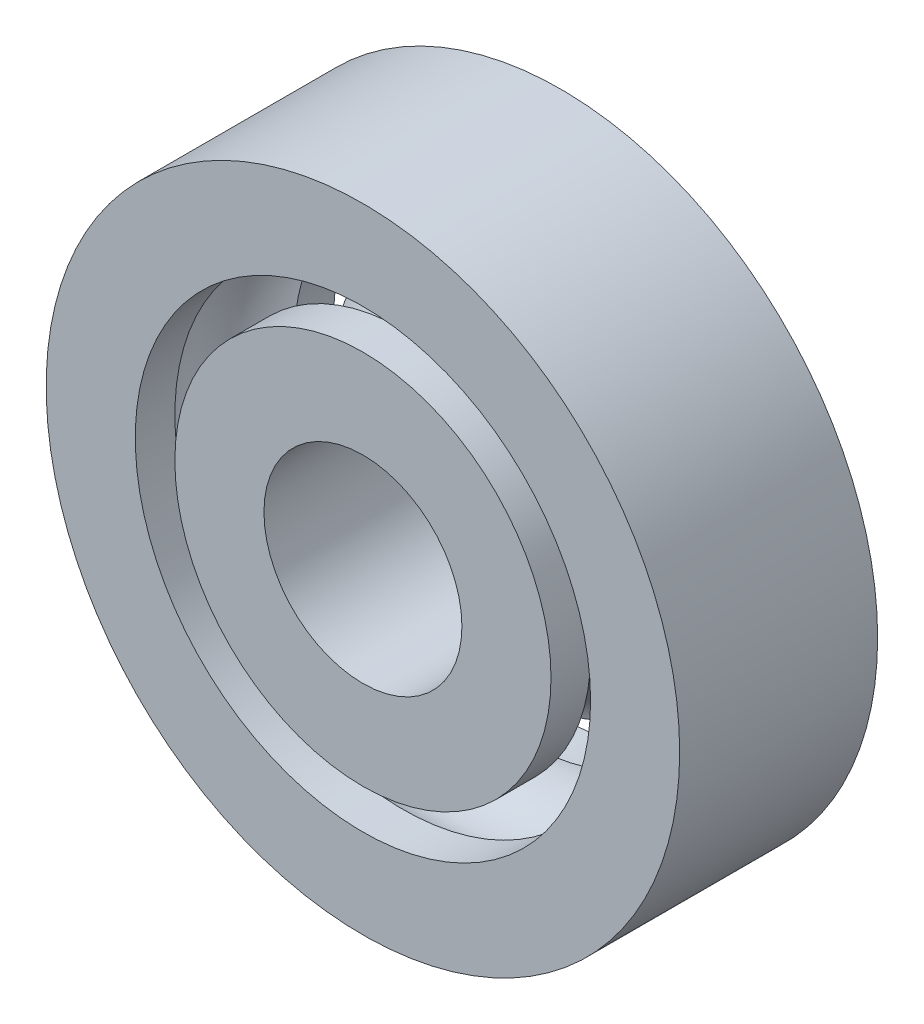
ISO-10303-21;
HEADER;
FILE_DESCRIPTION(('STEP AP214'),'2;1');
FILE_NAME('part.step','',(''),(''),'','','');
FILE_SCHEMA(('AUTOMOTIVE_DESIGN { 1 0 10303 214 1 1 1 1 }'));
ENDSEC;
DATA;
#1=APPLICATION_CONTEXT('core data for automotive mechanical design processes');
#2=APPLICATION_PROTOCOL_DEFINITION('international standard','automotive_design',2000,#1);
#3=PRODUCT_CONTEXT('',#1,'mechanical');
#4=PRODUCT('Part','Part','',(#3));
#5=PRODUCT_RELATED_PRODUCT_CATEGORY('part','',(#4));
#6=PRODUCT_DEFINITION_FORMATION('','',#4);
#7=PRODUCT_DEFINITION_CONTEXT('part definition',#1,'design');
#8=PRODUCT_DEFINITION('design','',#6,#7);
#9=PRODUCT_DEFINITION_SHAPE('','',#8);
#10=(LENGTH_UNIT() NAMED_UNIT(*) SI_UNIT(.MILLI.,.METRE.));
#11=(NAMED_UNIT(*) PLANE_ANGLE_UNIT() SI_UNIT($,.RADIAN.));
#12=(NAMED_UNIT(*) SI_UNIT($,.STERADIAN.) SOLID_ANGLE_UNIT());
#13=UNCERTAINTY_MEASURE_WITH_UNIT(LENGTH_MEASURE(1.E-05),#10,'distance_accuracy_value','');
#14=(GEOMETRIC_REPRESENTATION_CONTEXT(3) GLOBAL_UNCERTAINTY_ASSIGNED_CONTEXT((#13)) GLOBAL_UNIT_ASSIGNED_CONTEXT((#10,
#11,#12)) REPRESENTATION_CONTEXT('',''));
#15=CARTESIAN_POINT('',(0.,0.,0.));
#16=DIRECTION('',(0.,0.,1.));
#17=DIRECTION('',(1.,0.,0.));
#18=AXIS2_PLACEMENT_3D('',#15,#16,#17);
#19=CARTESIAN_POINT('',(0.,0.,2.5));
#20=DIRECTION('',(0.,0.,1.));
#21=DIRECTION('',(1.,0.,0.));
#22=AXIS2_PLACEMENT_3D('',#19,#20,#21);
#23=PLANE('',#22);
#24=CARTESIAN_POINT('',(0.,0.,2.5));
#25=DIRECTION('',(0.,0.,1.));
#26=DIRECTION('',(1.,0.,0.));
#27=AXIS2_PLACEMENT_3D('',#24,#25,#26);
#28=CIRCLE('',#27,8.);
#29=CARTESIAN_POINT('',(8.,0.,2.5));
#30=VERTEX_POINT('',#29);
#31=EDGE_CURVE('E55',#30,#30,#28,.T.);
#32=ORIENTED_EDGE('',*,*,#31,.T.);
#33=EDGE_LOOP('',(#32));
#34=FACE_BOUND('',#33,.T.);
#35=CARTESIAN_POINT('',(0.,0.,2.5));
#36=DIRECTION('',(0.,0.,1.));
#37=DIRECTION('',(1.,0.,0.));
#38=AXIS2_PLACEMENT_3D('',#35,#36,#37);
#39=CIRCLE('',#38,5.75);
#40=CARTESIAN_POINT('',(5.75,0.,2.5));
#41=VERTEX_POINT('',#40);
#42=EDGE_CURVE('E11',#41,#41,#39,.T.);
#43=ORIENTED_EDGE('',*,*,#42,.F.);
#44=EDGE_LOOP('',(#43));
#45=FACE_BOUND('',#44,.T.);
#46=ADVANCED_FACE('F49',(#34,#45),#23,.T.);
#47=CARTESIAN_POINT('',(0.,0.,2.5));
#48=DIRECTION('',(0.,0.,1.));
#49=DIRECTION('',(1.,0.,0.));
#50=AXIS2_PLACEMENT_3D('',#47,#48,#49);
#51=CYLINDRICAL_SURFACE('',#50,5.75);
#52=CARTESIAN_POINT('',(0.,0.,1.5));
#53=DIRECTION('',(0.,0.,1.));
#54=DIRECTION('',(1.,0.,0.));
#55=AXIS2_PLACEMENT_3D('',#52,#53,#54);
#56=CIRCLE('',#55,5.75);
#57=CARTESIAN_POINT('',(5.75,0.,1.5));
#58=VERTEX_POINT('',#57);
#59=EDGE_CURVE('E71',#58,#58,#56,.T.);
#60=ORIENTED_EDGE('',*,*,#59,.F.);
#61=EDGE_LOOP('',(#60));
#62=FACE_BOUND('',#61,.T.);
#63=ORIENTED_EDGE('',*,*,#42,.T.);
#64=EDGE_LOOP('',(#63));
#65=FACE_BOUND('',#64,.T.);
#66=ADVANCED_FACE('F77',(#62,#65),#51,.F.);
#67=CARTESIAN_POINT('',(0.,0.,2.5));
#68=DIRECTION('',(0.,0.,1.));
#69=DIRECTION('',(1.,0.,0.));
#70=AXIS2_PLACEMENT_3D('',#67,#68,#69);
#71=CYLINDRICAL_SURFACE('',#70,8.);
#72=CARTESIAN_POINT('',(0.,0.,-2.5));
#73=DIRECTION('',(0.,0.,1.));
#74=DIRECTION('',(1.,0.,0.));
#75=AXIS2_PLACEMENT_3D('',#72,#73,#74);
#76=CIRCLE('',#75,8.);
#77=CARTESIAN_POINT('',(8.,0.,-2.5));
#78=VERTEX_POINT('',#77);
#79=EDGE_CURVE('E59',#78,#78,#76,.T.);
#80=ORIENTED_EDGE('',*,*,#79,.T.);
#81=EDGE_LOOP('',(#80));
#82=FACE_BOUND('',#81,.T.);
#83=ORIENTED_EDGE('',*,*,#31,.F.);
#84=EDGE_LOOP('',(#83));
#85=FACE_BOUND('',#84,.T.);
#86=ADVANCED_FACE('F79',(#82,#85),#71,.T.);
#87=CARTESIAN_POINT('',(0.,0.,-2.5));
#88=DIRECTION('',(0.,0.,1.));
#89=DIRECTION('',(1.,0.,0.));
#90=AXIS2_PLACEMENT_3D('',#87,#88,#89);
#91=PLANE('',#90);
#92=ORIENTED_EDGE('',*,*,#79,.F.);
#93=EDGE_LOOP('',(#92));
#94=FACE_BOUND('',#93,.T.);
#95=CARTESIAN_POINT('',(0.,0.,-2.5));
#96=DIRECTION('',(0.,0.,1.));
#97=DIRECTION('',(1.,0.,0.));
#98=AXIS2_PLACEMENT_3D('',#95,#96,#97);
#99=CIRCLE('',#98,5.75);
#100=CARTESIAN_POINT('',(5.75,0.,-2.5));
#101=VERTEX_POINT('',#100);
#102=EDGE_CURVE('E63',#101,#101,#99,.T.);
#103=ORIENTED_EDGE('',*,*,#102,.T.);
#104=EDGE_LOOP('',(#103));
#105=FACE_BOUND('',#104,.T.);
#106=ADVANCED_FACE('F85',(#94,#105),#91,.F.);
#107=CARTESIAN_POINT('',(0.,0.,2.5));
#108=DIRECTION('',(0.,0.,1.));
#109=DIRECTION('',(1.,0.,0.));
#110=AXIS2_PLACEMENT_3D('',#107,#108,#109);
#111=CYLINDRICAL_SURFACE('',#110,5.75);
#112=CARTESIAN_POINT('',(0.,0.,-1.5));
#113=DIRECTION('',(0.,0.,1.));
#114=DIRECTION('',(1.,0.,0.));
#115=AXIS2_PLACEMENT_3D('',#112,#113,#114);
#116=CIRCLE('',#115,5.75);
#117=CARTESIAN_POINT('',(5.75,0.,-1.5));
#118=VERTEX_POINT('',#117);
#119=EDGE_CURVE('E68',#118,#118,#116,.T.);
#120=ORIENTED_EDGE('',*,*,#119,.T.);
#121=EDGE_LOOP('',(#120));
#122=FACE_BOUND('',#121,.T.);
#123=ORIENTED_EDGE('',*,*,#102,.F.);
#124=EDGE_LOOP('',(#123));
#125=FACE_BOUND('',#124,.T.);
#126=ADVANCED_FACE('F90',(#122,#125),#111,.F.);
#127=CARTESIAN_POINT('',(0.,0.,0.));
#128=DIRECTION('',(0.,0.,1.));
#129=DIRECTION('',(1.,0.,0.));
#130=AXIS2_PLACEMENT_3D('',#127,#128,#129);
#131=TOROIDAL_SURFACE('',#130,5.25,1.58113883008419);
#132=ORIENTED_EDGE('',*,*,#119,.F.);
#133=EDGE_LOOP('',(#132));
#134=FACE_BOUND('',#133,.T.);
#135=ORIENTED_EDGE('',*,*,#59,.T.);
#136=EDGE_LOOP('',(#135));
#137=FACE_BOUND('',#136,.T.);
#138=ADVANCED_FACE('F75',(#134,#137),#131,.F.);
#139=CLOSED_SHELL('',(#46,#66,#86,#106,#126,#138));
#140=MANIFOLD_SOLID_BREP('B2',#139);
#141=CARTESIAN_POINT('',(0.,0.,0.));
#142=DIRECTION('',(0.,0.,1.));
#143=DIRECTION('',(1.,0.,0.));
#144=AXIS2_PLACEMENT_3D('',#141,#142,#143);
#145=TOROIDAL_SURFACE('',#144,5.25,1.58113883008419);
#146=CARTESIAN_POINT('',(0.,0.,-1.5));
#147=DIRECTION('',(0.,0.,1.));
#148=DIRECTION('',(1.,0.,0.));
#149=AXIS2_PLACEMENT_3D('',#146,#147,#148);
#150=CIRCLE('',#149,4.75);
#151=CARTESIAN_POINT('',(4.75,0.,-1.5));
#152=VERTEX_POINT('',#151);
#153=EDGE_CURVE('E195',#152,#152,#150,.T.);
#154=ORIENTED_EDGE('',*,*,#153,.T.);
#155=EDGE_LOOP('',(#154));
#156=FACE_BOUND('',#155,.T.);
#157=CARTESIAN_POINT('',(0.,0.,1.5));
#158=DIRECTION('',(0.,0.,1.));
#159=DIRECTION('',(1.,0.,0.));
#160=AXIS2_PLACEMENT_3D('',#157,#158,#159);
#161=CIRCLE('',#160,4.75);
#162=CARTESIAN_POINT('',(4.75,0.,1.5));
#163=VERTEX_POINT('',#162);
#164=EDGE_CURVE('E48',#163,#163,#161,.T.);
#165=ORIENTED_EDGE('',*,*,#164,.F.);
#166=EDGE_LOOP('',(#165));
#167=FACE_BOUND('',#166,.T.);
#168=ADVANCED_FACE('F173',(#156,#167),#145,.F.);
#169=CARTESIAN_POINT('',(0.,0.,2.5));
#170=DIRECTION('',(0.,0.,1.));
#171=DIRECTION('',(1.,0.,0.));
#172=AXIS2_PLACEMENT_3D('',#169,#170,#171);
#173=CYLINDRICAL_SURFACE('',#172,4.75);
#174=ORIENTED_EDGE('',*,*,#164,.T.);
#175=EDGE_LOOP('',(#174));
#176=FACE_BOUND('',#175,.T.);
#177=CARTESIAN_POINT('',(0.,0.,2.5));
#178=DIRECTION('',(0.,0.,1.));
#179=DIRECTION('',(1.,0.,0.));
#180=AXIS2_PLACEMENT_3D('',#177,#178,#179);
#181=CIRCLE('',#180,4.75);
#182=CARTESIAN_POINT('',(4.75,0.,2.5));
#183=VERTEX_POINT('',#182);
#184=EDGE_CURVE('E179',#183,#183,#181,.T.);
#185=ORIENTED_EDGE('',*,*,#184,.F.);
#186=EDGE_LOOP('',(#185));
#187=FACE_BOUND('',#186,.T.);
#188=ADVANCED_FACE('F221',(#176,#187),#173,.T.);
#189=CARTESIAN_POINT('',(0.,0.,2.5));
#190=DIRECTION('',(0.,0.,1.));
#191=DIRECTION('',(1.,0.,0.));
#192=AXIS2_PLACEMENT_3D('',#189,#190,#191);
#193=PLANE('',#192);
#194=ORIENTED_EDGE('',*,*,#184,.T.);
#195=EDGE_LOOP('',(#194));
#196=FACE_BOUND('',#195,.T.);
#197=CARTESIAN_POINT('',(0.,0.,2.5));
#198=DIRECTION('',(0.,0.,1.));
#199=DIRECTION('',(1.,0.,0.));
#200=AXIS2_PLACEMENT_3D('',#197,#198,#199);
#201=CIRCLE('',#200,2.5);
#202=CARTESIAN_POINT('',(2.5,0.,2.5));
#203=VERTEX_POINT('',#202);
#204=EDGE_CURVE('E183',#203,#203,#201,.T.);
#205=ORIENTED_EDGE('',*,*,#204,.F.);
#206=EDGE_LOOP('',(#205));
#207=FACE_BOUND('',#206,.T.);
#208=ADVANCED_FACE('F216',(#196,#207),#193,.T.);
#209=CARTESIAN_POINT('',(0.,0.,2.5));
#210=DIRECTION('',(0.,0.,1.));
#211=DIRECTION('',(1.,0.,0.));
#212=AXIS2_PLACEMENT_3D('',#209,#210,#211);
#213=CYLINDRICAL_SURFACE('',#212,2.5);
#214=CARTESIAN_POINT('',(0.,0.,-2.5));
#215=DIRECTION('',(0.,0.,1.));
#216=DIRECTION('',(1.,0.,0.));
#217=AXIS2_PLACEMENT_3D('',#214,#215,#216);
#218=CIRCLE('',#217,2.5);
#219=CARTESIAN_POINT('',(2.5,0.,-2.5));
#220=VERTEX_POINT('',#219);
#221=EDGE_CURVE('E187',#220,#220,#218,.T.);
#222=ORIENTED_EDGE('',*,*,#221,.F.);
#223=EDGE_LOOP('',(#222));
#224=FACE_BOUND('',#223,.T.);
#225=ORIENTED_EDGE('',*,*,#204,.T.);
#226=EDGE_LOOP('',(#225));
#227=FACE_BOUND('',#226,.T.);
#228=ADVANCED_FACE('F210',(#224,#227),#213,.F.);
#229=CARTESIAN_POINT('',(0.,0.,-2.5));
#230=DIRECTION('',(0.,0.,1.));
#231=DIRECTION('',(1.,0.,0.));
#232=AXIS2_PLACEMENT_3D('',#229,#230,#231);
#233=PLANE('',#232);
#234=CARTESIAN_POINT('',(0.,0.,-2.5));
#235=DIRECTION('',(0.,0.,1.));
#236=DIRECTION('',(1.,0.,0.));
#237=AXIS2_PLACEMENT_3D('',#234,#235,#236);
#238=CIRCLE('',#237,4.75);
#239=CARTESIAN_POINT('',(4.75,0.,-2.5));
#240=VERTEX_POINT('',#239);
#241=EDGE_CURVE('E192',#240,#240,#238,.T.);
#242=ORIENTED_EDGE('',*,*,#241,.F.);
#243=EDGE_LOOP('',(#242));
#244=FACE_BOUND('',#243,.T.);
#245=ORIENTED_EDGE('',*,*,#221,.T.);
#246=EDGE_LOOP('',(#245));
#247=FACE_BOUND('',#246,.T.);
#248=ADVANCED_FACE('F204',(#244,#247),#233,.F.);
#249=CARTESIAN_POINT('',(0.,0.,2.5));
#250=DIRECTION('',(0.,0.,1.));
#251=DIRECTION('',(1.,0.,0.));
#252=AXIS2_PLACEMENT_3D('',#249,#250,#251);
#253=CYLINDRICAL_SURFACE('',#252,4.75);
#254=ORIENTED_EDGE('',*,*,#153,.F.);
#255=EDGE_LOOP('',(#254));
#256=FACE_BOUND('',#255,.T.);
#257=ORIENTED_EDGE('',*,*,#241,.T.);
#258=EDGE_LOOP('',(#257));
#259=FACE_BOUND('',#258,.T.);
#260=ADVANCED_FACE('F201',(#256,#259),#253,.T.);
#261=CLOSED_SHELL('',(#168,#188,#208,#228,#248,#260));
#262=MANIFOLD_SOLID_BREP('B6',#261);
#263=ADVANCED_BREP_SHAPE_REPRESENTATION('',(#18,#140,#262),#14);
#264=SHAPE_DEFINITION_REPRESENTATION(#9,#263);
ENDSEC;
END-ISO-10303-21;
